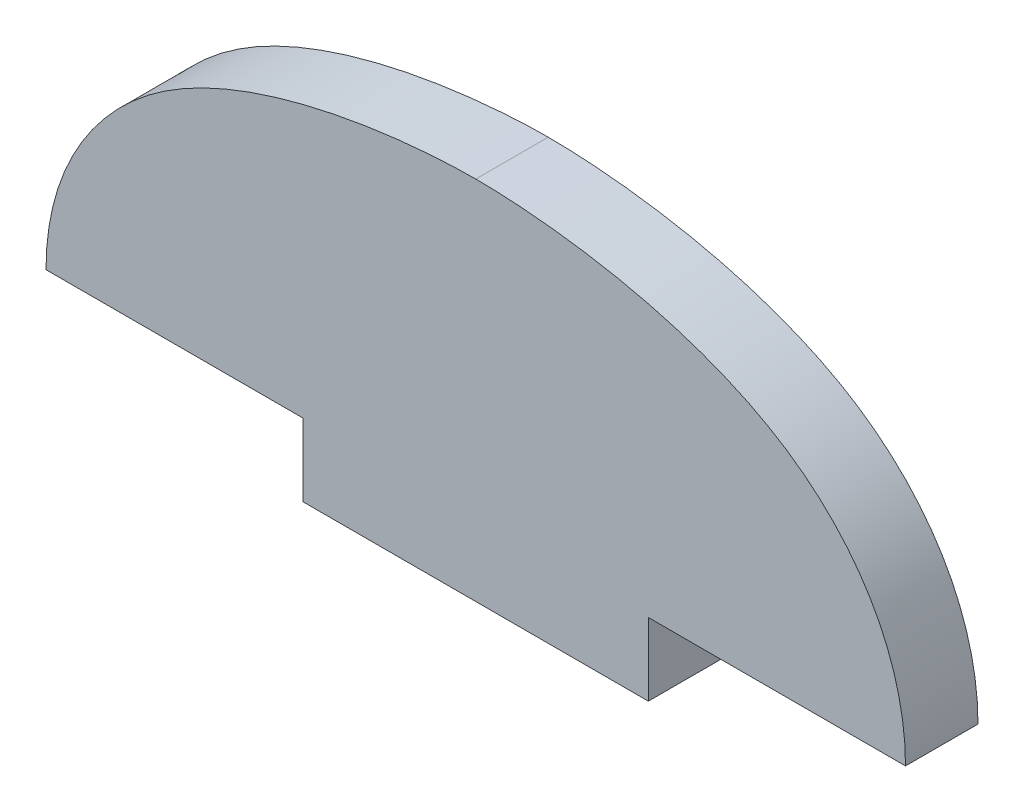
ISO-10303-21;
HEADER;
FILE_DESCRIPTION(('STEP AP214'),'2;1');
FILE_NAME('part.step','',(''),(''),'','','');
FILE_SCHEMA(('AUTOMOTIVE_DESIGN { 1 0 10303 214 1 1 1 1 }'));
ENDSEC;
DATA;
#1=APPLICATION_CONTEXT('core data for automotive mechanical design processes');
#2=APPLICATION_PROTOCOL_DEFINITION('international standard','automotive_design',2000,#1);
#3=PRODUCT_CONTEXT('',#1,'mechanical');
#4=PRODUCT('Part','Part','',(#3));
#5=PRODUCT_RELATED_PRODUCT_CATEGORY('part','',(#4));
#6=PRODUCT_DEFINITION_FORMATION('','',#4);
#7=PRODUCT_DEFINITION_CONTEXT('part definition',#1,'design');
#8=PRODUCT_DEFINITION('design','',#6,#7);
#9=PRODUCT_DEFINITION_SHAPE('','',#8);
#10=(LENGTH_UNIT() NAMED_UNIT(*) SI_UNIT(.MILLI.,.METRE.));
#11=(NAMED_UNIT(*) PLANE_ANGLE_UNIT() SI_UNIT($,.RADIAN.));
#12=(NAMED_UNIT(*) SI_UNIT($,.STERADIAN.) SOLID_ANGLE_UNIT());
#13=UNCERTAINTY_MEASURE_WITH_UNIT(LENGTH_MEASURE(1.E-05),#10,'distance_accuracy_value','');
#14=(GEOMETRIC_REPRESENTATION_CONTEXT(3) GLOBAL_UNCERTAINTY_ASSIGNED_CONTEXT((#13)) GLOBAL_UNIT_ASSIGNED_CONTEXT((#10,
#11,#12)) REPRESENTATION_CONTEXT('',''));
#15=CARTESIAN_POINT('',(0.,0.,0.));
#16=DIRECTION('',(0.,0.,1.));
#17=DIRECTION('',(1.,0.,0.));
#18=AXIS2_PLACEMENT_3D('',#15,#16,#17);
#19=CARTESIAN_POINT('',(0.,41.4528,5.334));
#20=DIRECTION('',(0.,1.,0.));
#21=DIRECTION('',(0.,0.,1.));
#22=AXIS2_PLACEMENT_3D('',#19,#20,#21);
#23=PLANE('',#22);
#24=DIRECTION('',(0.,0.,-1.));
#25=VECTOR('',#24,1.);
#26=CARTESIAN_POINT('',(-12.7,41.4528,5.334));
#27=LINE('',#26,#25);
#28=CARTESIAN_POINT('',(-12.7,41.4528,5.334));
#29=VERTEX_POINT('',#28);
#30=CARTESIAN_POINT('',(-12.7,41.4528,0.));
#31=VERTEX_POINT('',#30);
#32=EDGE_CURVE('E11',#29,#31,#27,.T.);
#33=ORIENTED_EDGE('',*,*,#32,.F.);
#34=DIRECTION('',(1.,0.,0.));
#35=VECTOR('',#34,1.);
#36=CARTESIAN_POINT('',(0.,41.4528,5.334));
#37=LINE('',#36,#35);
#38=CARTESIAN_POINT('',(-31.623,41.4528,5.334));
#39=VERTEX_POINT('',#38);
#40=EDGE_CURVE('E179',#39,#29,#37,.T.);
#41=ORIENTED_EDGE('',*,*,#40,.F.);
#42=DIRECTION('',(0.,0.,-1.));
#43=VECTOR('',#42,1.);
#44=CARTESIAN_POINT('',(-31.623,41.4528,5.334));
#45=LINE('',#44,#43);
#46=CARTESIAN_POINT('',(-31.623,41.4528,0.));
#47=VERTEX_POINT('',#46);
#48=EDGE_CURVE('E108',#39,#47,#45,.T.);
#49=ORIENTED_EDGE('',*,*,#48,.T.);
#50=DIRECTION('',(1.,0.,0.));
#51=VECTOR('',#50,1.);
#52=CARTESIAN_POINT('',(0.,41.4528,0.));
#53=LINE('',#52,#51);
#54=EDGE_CURVE('E126',#47,#31,#53,.T.);
#55=ORIENTED_EDGE('',*,*,#54,.T.);
#56=EDGE_LOOP('',(#33,#41,#49,#55));
#57=FACE_BOUND('',#56,.T.);
#58=ADVANCED_FACE('F35',(#57),#23,.F.);
#59=DIRECTION('',(0.,0.,1.));
#60=VECTOR('',#59,1.);
#61=CARTESIAN_POINT('',(12.7,41.4528,5.334));
#62=LINE('',#61,#60);
#63=CARTESIAN_POINT('',(12.7,41.4528,0.));
#64=VERTEX_POINT('',#63);
#65=CARTESIAN_POINT('',(12.7,41.4528,5.334));
#66=VERTEX_POINT('',#65);
#67=EDGE_CURVE('E45',#64,#66,#62,.T.);
#68=ORIENTED_EDGE('',*,*,#67,.F.);
#69=CARTESIAN_POINT('',(31.623,41.4528,0.));
#70=VERTEX_POINT('',#69);
#71=EDGE_CURVE('E91',#64,#70,#53,.T.);
#72=ORIENTED_EDGE('',*,*,#71,.T.);
#73=DIRECTION('',(0.,0.,-1.));
#74=VECTOR('',#73,1.);
#75=CARTESIAN_POINT('',(31.623,41.4528,5.334));
#76=LINE('',#75,#74);
#77=CARTESIAN_POINT('',(31.623,41.4528,5.334));
#78=VERTEX_POINT('',#77);
#79=EDGE_CURVE('E102',#78,#70,#76,.T.);
#80=ORIENTED_EDGE('',*,*,#79,.F.);
#81=EDGE_CURVE('E117',#66,#78,#37,.T.);
#82=ORIENTED_EDGE('',*,*,#81,.F.);
#83=EDGE_LOOP('',(#68,#72,#80,#82));
#84=FACE_BOUND('',#83,.T.);
#85=ADVANCED_FACE('F156',(#84),#23,.F.);
#86=CARTESIAN_POINT('',(31.623,41.4528,5.334));
#87=CARTESIAN_POINT('',(31.623,47.9413908233419,5.334));
#88=CARTESIAN_POINT('',(23.8907681013121,61.0437843746972,5.334));
#89=CARTESIAN_POINT('',(5.25519417308524,63.0428,5.334));
#90=CARTESIAN_POINT('',(0.,63.0428,5.334));
#91=B_SPLINE_CURVE_WITH_KNOTS('',3,(#86,#87,#88,#89,#90),.UNSPECIFIED.,.F.,.F.,(4,1,4),(0.,
0.432269255399907,1.),.UNSPECIFIED.);
#92=DIRECTION('',(0.,0.,-1.));
#93=VECTOR('',#92,1.);
#94=SURFACE_OF_LINEAR_EXTRUSION('',#91,#93);
#95=CARTESIAN_POINT('',(31.623,41.4528,0.));
#96=CARTESIAN_POINT('',(31.623,47.9413908233419,0.));
#97=CARTESIAN_POINT('',(23.8907681013121,61.0437843746972,0.));
#98=CARTESIAN_POINT('',(5.25519417308524,63.0428,0.));
#99=CARTESIAN_POINT('',(0.,63.0428,0.));
#100=B_SPLINE_CURVE_WITH_KNOTS('',3,(#95,#96,#97,#98,#99),.UNSPECIFIED.,.F.,.F.,(4,1,4),(0.,
0.432269255399907,1.),.UNSPECIFIED.);
#101=CARTESIAN_POINT('',(0.,63.0428,0.));
#102=VERTEX_POINT('',#101);
#103=EDGE_CURVE('E118',#70,#102,#100,.T.);
#104=ORIENTED_EDGE('',*,*,#103,.T.);
#105=DIRECTION('',(0.,0.,-1.));
#106=VECTOR('',#105,1.);
#107=CARTESIAN_POINT('',(0.,63.0428,5.334));
#108=LINE('',#107,#106);
#109=CARTESIAN_POINT('',(0.,63.0428,5.334));
#110=VERTEX_POINT('',#109);
#111=EDGE_CURVE('E105',#110,#102,#108,.T.);
#112=ORIENTED_EDGE('',*,*,#111,.F.);
#113=EDGE_CURVE('E137',#78,#110,#91,.T.);
#114=ORIENTED_EDGE('',*,*,#113,.F.);
#115=ORIENTED_EDGE('',*,*,#79,.T.);
#116=EDGE_LOOP('',(#104,#112,#114,#115));
#117=FACE_BOUND('',#116,.T.);
#118=ADVANCED_FACE('F151',(#117),#94,.F.);
#119=CARTESIAN_POINT('',(-31.623,41.4528,5.334));
#120=CARTESIAN_POINT('',(-31.623,47.9413908233419,5.334));
#121=CARTESIAN_POINT('',(-23.8907681013121,61.0437843746972,5.334));
#122=CARTESIAN_POINT('',(-5.25519417308523,63.0428,5.334));
#123=CARTESIAN_POINT('',(0.,63.0428,5.334));
#124=B_SPLINE_CURVE_WITH_KNOTS('',3,(#119,#120,#121,#122,#123),.UNSPECIFIED.,.F.,.F.,(4,1,4),
(0.,0.432269255399907,1.),.UNSPECIFIED.);
#125=DIRECTION('',(0.,0.,-1.));
#126=VECTOR('',#125,1.);
#127=SURFACE_OF_LINEAR_EXTRUSION('',#124,#126);
#128=CARTESIAN_POINT('',(-31.623,41.4528,0.));
#129=CARTESIAN_POINT('',(-31.623,47.9413908233419,0.));
#130=CARTESIAN_POINT('',(-23.8907681013121,61.0437843746972,0.));
#131=CARTESIAN_POINT('',(-5.25519417308523,63.0428,0.));
#132=CARTESIAN_POINT('',(0.,63.0428,0.));
#133=B_SPLINE_CURVE_WITH_KNOTS('',3,(#128,#129,#130,#131,#132),.UNSPECIFIED.,.F.,.F.,(4,1,4),
(0.,0.432269255399907,1.),.UNSPECIFIED.);
#134=EDGE_CURVE('E112',#47,#102,#133,.T.);
#135=ORIENTED_EDGE('',*,*,#134,.F.);
#136=ORIENTED_EDGE('',*,*,#48,.F.);
#137=EDGE_CURVE('E111',#39,#110,#124,.T.);
#138=ORIENTED_EDGE('',*,*,#137,.T.);
#139=ORIENTED_EDGE('',*,*,#111,.T.);
#140=EDGE_LOOP('',(#135,#136,#138,#139));
#141=FACE_BOUND('',#140,.T.);
#142=ADVANCED_FACE('F146',(#141),#127,.T.);
#143=CARTESIAN_POINT('',(0.,0.,5.334));
#144=DIRECTION('',(0.,0.,1.));
#145=DIRECTION('',(1.,0.,0.));
#146=AXIS2_PLACEMENT_3D('',#143,#144,#145);
#147=PLANE('',#146);
#148=ORIENTED_EDGE('',*,*,#40,.T.);
#149=DIRECTION('',(0.,-1.,0.));
#150=VECTOR('',#149,1.);
#151=CARTESIAN_POINT('',(-12.7,41.4528,5.334));
#152=LINE('',#151,#150);
#153=CARTESIAN_POINT('',(-12.7,36.1188,5.334));
#154=VERTEX_POINT('',#153);
#155=EDGE_CURVE('E92',#29,#154,#152,.T.);
#156=ORIENTED_EDGE('',*,*,#155,.T.);
#157=DIRECTION('',(1.,0.,0.));
#158=VECTOR('',#157,1.);
#159=CARTESIAN_POINT('',(-12.7,36.1188,5.334));
#160=LINE('',#159,#158);
#161=CARTESIAN_POINT('',(12.7,36.1188,5.334));
#162=VERTEX_POINT('',#161);
#163=EDGE_CURVE('E95',#154,#162,#160,.T.);
#164=ORIENTED_EDGE('',*,*,#163,.T.);
#165=DIRECTION('',(0.,1.,0.));
#166=VECTOR('',#165,1.);
#167=CARTESIAN_POINT('',(12.7,36.1188,5.334));
#168=LINE('',#167,#166);
#169=EDGE_CURVE('E86',#162,#66,#168,.T.);
#170=ORIENTED_EDGE('',*,*,#169,.T.);
#171=ORIENTED_EDGE('',*,*,#81,.T.);
#172=ORIENTED_EDGE('',*,*,#113,.T.);
#173=ORIENTED_EDGE('',*,*,#137,.F.);
#174=EDGE_LOOP('',(#148,#156,#164,#170,#171,#172,#173));
#175=FACE_BOUND('',#174,.T.);
#176=ADVANCED_FACE('F150',(#175),#147,.T.);
#177=CARTESIAN_POINT('',(0.,0.,0.));
#178=DIRECTION('',(0.,0.,1.));
#179=DIRECTION('',(1.,0.,0.));
#180=AXIS2_PLACEMENT_3D('',#177,#178,#179);
#181=PLANE('',#180);
#182=ORIENTED_EDGE('',*,*,#54,.F.);
#183=ORIENTED_EDGE('',*,*,#134,.T.);
#184=ORIENTED_EDGE('',*,*,#103,.F.);
#185=ORIENTED_EDGE('',*,*,#71,.F.);
#186=DIRECTION('',(0.,1.,0.));
#187=VECTOR('',#186,1.);
#188=CARTESIAN_POINT('',(12.7,36.1188,0.));
#189=LINE('',#188,#187);
#190=CARTESIAN_POINT('',(12.7,36.1188,0.));
#191=VERTEX_POINT('',#190);
#192=EDGE_CURVE('E81',#191,#64,#189,.T.);
#193=ORIENTED_EDGE('',*,*,#192,.F.);
#194=DIRECTION('',(1.,0.,0.));
#195=VECTOR('',#194,1.);
#196=CARTESIAN_POINT('',(-12.7,36.1188,0.));
#197=LINE('',#196,#195);
#198=CARTESIAN_POINT('',(-12.7,36.1188,0.));
#199=VERTEX_POINT('',#198);
#200=EDGE_CURVE('E72',#199,#191,#197,.T.);
#201=ORIENTED_EDGE('',*,*,#200,.F.);
#202=DIRECTION('',(0.,-1.,0.));
#203=VECTOR('',#202,1.);
#204=CARTESIAN_POINT('',(-12.7,41.4528,0.));
#205=LINE('',#204,#203);
#206=EDGE_CURVE('E82',#31,#199,#205,.T.);
#207=ORIENTED_EDGE('',*,*,#206,.F.);
#208=EDGE_LOOP('',(#182,#183,#184,#185,#193,#201,#207));
#209=FACE_BOUND('',#208,.T.);
#210=ADVANCED_FACE('F88',(#209),#181,.F.);
#211=CARTESIAN_POINT('',(-12.7,36.1188,5.334));
#212=DIRECTION('',(0.,1.,0.));
#213=DIRECTION('',(-1.,0.,0.));
#214=AXIS2_PLACEMENT_3D('',#211,#212,#213);
#215=PLANE('',#214);
#216=ORIENTED_EDGE('',*,*,#200,.T.);
#217=DIRECTION('',(0.,0.,-1.));
#218=VECTOR('',#217,1.);
#219=CARTESIAN_POINT('',(12.7,36.1188,5.334));
#220=LINE('',#219,#218);
#221=EDGE_CURVE('E78',#162,#191,#220,.T.);
#222=ORIENTED_EDGE('',*,*,#221,.F.);
#223=ORIENTED_EDGE('',*,*,#163,.F.);
#224=DIRECTION('',(0.,0.,-1.));
#225=VECTOR('',#224,1.);
#226=CARTESIAN_POINT('',(-12.7,36.1188,5.334));
#227=LINE('',#226,#225);
#228=EDGE_CURVE('E39',#154,#199,#227,.T.);
#229=ORIENTED_EDGE('',*,*,#228,.T.);
#230=EDGE_LOOP('',(#216,#222,#223,#229));
#231=FACE_BOUND('',#230,.T.);
#232=ADVANCED_FACE('F77',(#231),#215,.F.);
#233=CARTESIAN_POINT('',(12.7,36.1188,5.334));
#234=DIRECTION('',(-1.,0.,0.));
#235=DIRECTION('',(0.,0.,1.));
#236=AXIS2_PLACEMENT_3D('',#233,#234,#235);
#237=PLANE('',#236);
#238=ORIENTED_EDGE('',*,*,#192,.T.);
#239=ORIENTED_EDGE('',*,*,#67,.T.);
#240=ORIENTED_EDGE('',*,*,#169,.F.);
#241=ORIENTED_EDGE('',*,*,#221,.T.);
#242=EDGE_LOOP('',(#238,#239,#240,#241));
#243=FACE_BOUND('',#242,.T.);
#244=ADVANCED_FACE('F84',(#243),#237,.F.);
#245=CARTESIAN_POINT('',(-12.7,41.4528,5.334));
#246=DIRECTION('',(1.,0.,0.));
#247=DIRECTION('',(0.,0.,-1.));
#248=AXIS2_PLACEMENT_3D('',#245,#246,#247);
#249=PLANE('',#248);
#250=ORIENTED_EDGE('',*,*,#206,.T.);
#251=ORIENTED_EDGE('',*,*,#228,.F.);
#252=ORIENTED_EDGE('',*,*,#155,.F.);
#253=ORIENTED_EDGE('',*,*,#32,.T.);
#254=EDGE_LOOP('',(#250,#251,#252,#253));
#255=FACE_BOUND('',#254,.T.);
#256=ADVANCED_FACE('F37',(#255),#249,.F.);
#257=CLOSED_SHELL('',(#58,#85,#118,#142,#176,#210,#232,#244,#256));
#258=MANIFOLD_SOLID_BREP('B2',#257);
#259=ADVANCED_BREP_SHAPE_REPRESENTATION('',(#18,#258),#14);
#260=SHAPE_DEFINITION_REPRESENTATION(#9,#259);
ENDSEC;
END-ISO-10303-21;
